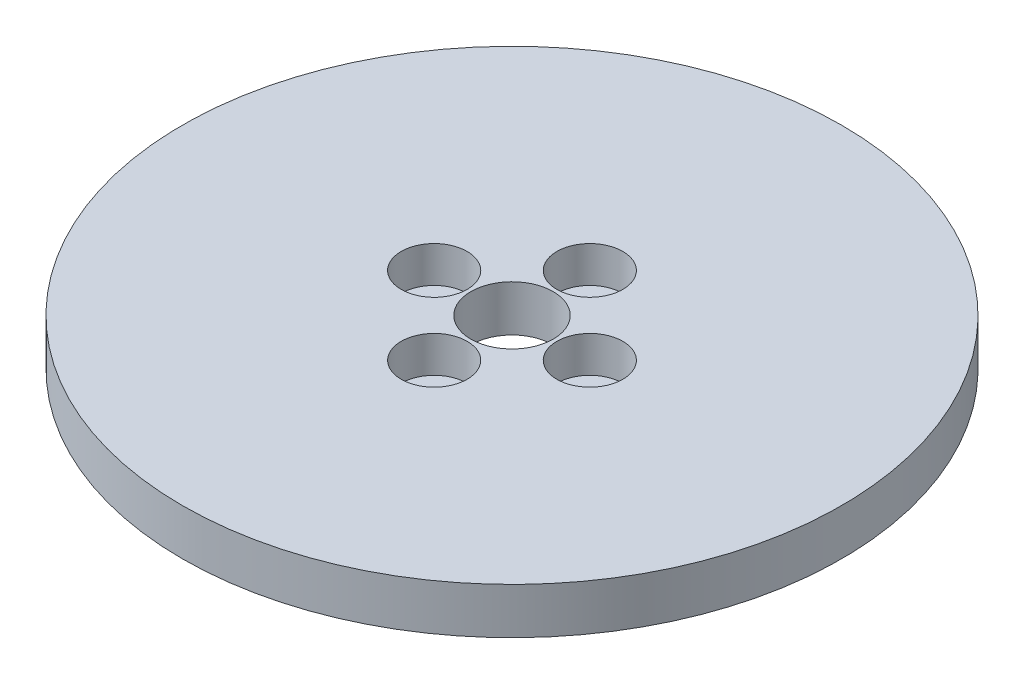
ISO-10303-21;
HEADER;
FILE_DESCRIPTION(('STEP AP214'),'2;1');
FILE_NAME('part.step','',(''),(''),'','','');
FILE_SCHEMA(('AUTOMOTIVE_DESIGN { 1 0 10303 214 1 1 1 1 }'));
ENDSEC;
DATA;
#1=APPLICATION_CONTEXT('core data for automotive mechanical design processes');
#2=APPLICATION_PROTOCOL_DEFINITION('international standard','automotive_design',2000,#1);
#3=PRODUCT_CONTEXT('',#1,'mechanical');
#4=PRODUCT('Part','Part','',(#3));
#5=PRODUCT_RELATED_PRODUCT_CATEGORY('part','',(#4));
#6=PRODUCT_DEFINITION_FORMATION('','',#4);
#7=PRODUCT_DEFINITION_CONTEXT('part definition',#1,'design');
#8=PRODUCT_DEFINITION('design','',#6,#7);
#9=PRODUCT_DEFINITION_SHAPE('','',#8);
#10=(LENGTH_UNIT() NAMED_UNIT(*) SI_UNIT(.MILLI.,.METRE.));
#11=(NAMED_UNIT(*) PLANE_ANGLE_UNIT() SI_UNIT($,.RADIAN.));
#12=(NAMED_UNIT(*) SI_UNIT($,.STERADIAN.) SOLID_ANGLE_UNIT());
#13=UNCERTAINTY_MEASURE_WITH_UNIT(LENGTH_MEASURE(1.E-05),#10,'distance_accuracy_value','');
#14=(GEOMETRIC_REPRESENTATION_CONTEXT(3) GLOBAL_UNCERTAINTY_ASSIGNED_CONTEXT((#13)) GLOBAL_UNIT_ASSIGNED_CONTEXT((#10,
#11,#12)) REPRESENTATION_CONTEXT('',''));
#15=CARTESIAN_POINT('',(0.,0.,0.));
#16=DIRECTION('',(0.,0.,1.));
#17=DIRECTION('',(1.,0.,0.));
#18=AXIS2_PLACEMENT_3D('',#15,#16,#17);
#19=CARTESIAN_POINT('',(0.,14.,0.));
#20=DIRECTION('',(0.,-1.,0.));
#21=DIRECTION('',(0.,0.,-1.));
#22=AXIS2_PLACEMENT_3D('',#19,#20,#21);
#23=CYLINDRICAL_SURFACE('',#22,100.);
#24=CARTESIAN_POINT('',(0.,14.,0.));
#25=DIRECTION('',(0.,1.,0.));
#26=DIRECTION('',(0.,0.,1.));
#27=AXIS2_PLACEMENT_3D('',#24,#25,#26);
#28=CIRCLE('',#27,100.);
#29=CARTESIAN_POINT('',(0.,14.,100.));
#30=VERTEX_POINT('',#29);
#31=EDGE_CURVE('E10',#30,#30,#28,.T.);
#32=ORIENTED_EDGE('',*,*,#31,.F.);
#33=EDGE_LOOP('',(#32));
#34=FACE_BOUND('',#33,.T.);
#35=CARTESIAN_POINT('',(0.,0.,0.));
#36=DIRECTION('',(0.,1.,0.));
#37=DIRECTION('',(0.,0.,1.));
#38=AXIS2_PLACEMENT_3D('',#35,#36,#37);
#39=CIRCLE('',#38,100.);
#40=CARTESIAN_POINT('',(0.,0.,100.));
#41=VERTEX_POINT('',#40);
#42=EDGE_CURVE('E37',#41,#41,#39,.T.);
#43=ORIENTED_EDGE('',*,*,#42,.T.);
#44=EDGE_LOOP('',(#43));
#45=FACE_BOUND('',#44,.T.);
#46=ADVANCED_FACE('F40',(#34,#45),#23,.T.);
#47=CARTESIAN_POINT('',(0.,14.,0.));
#48=DIRECTION('',(0.,1.,0.));
#49=DIRECTION('',(0.,0.,1.));
#50=AXIS2_PLACEMENT_3D('',#47,#48,#49);
#51=PLANE('',#50);
#52=CARTESIAN_POINT('',(0.,14.,23.6167152226861));
#53=DIRECTION('',(0.,1.,0.));
#54=DIRECTION('',(1.,0.,0.));
#55=AXIS2_PLACEMENT_3D('',#52,#53,#54);
#56=CIRCLE('',#55,10.);
#57=CARTESIAN_POINT('',(10.0000000000001,14.,23.6167152226861));
#58=VERTEX_POINT('',#57);
#59=EDGE_CURVE('E71',#58,#58,#56,.T.);
#60=ORIENTED_EDGE('',*,*,#59,.F.);
#61=EDGE_LOOP('',(#60));
#62=FACE_BOUND('',#61,.T.);
#63=CARTESIAN_POINT('',(23.6167152226861,14.,0.));
#64=DIRECTION('',(0.,1.,0.));
#65=DIRECTION('',(0.,0.,-1.));
#66=AXIS2_PLACEMENT_3D('',#63,#64,#65);
#67=CIRCLE('',#66,10.);
#68=CARTESIAN_POINT('',(23.6167152226861,14.,-10.));
#69=VERTEX_POINT('',#68);
#70=EDGE_CURVE('E70',#69,#69,#67,.T.);
#71=ORIENTED_EDGE('',*,*,#70,.F.);
#72=EDGE_LOOP('',(#71));
#73=FACE_BOUND('',#72,.T.);
#74=CARTESIAN_POINT('',(-2.47371961454343E-13,14.,-23.6167152226861));
#75=DIRECTION('',(0.,1.,0.));
#76=DIRECTION('',(-1.,0.,0.));
#77=AXIS2_PLACEMENT_3D('',#74,#75,#76);
#78=CIRCLE('',#77,10.);
#79=CARTESIAN_POINT('',(-10.0000000000002,14.,-23.616715222686));
#80=VERTEX_POINT('',#79);
#81=EDGE_CURVE('E61',#80,#80,#78,.T.);
#82=ORIENTED_EDGE('',*,*,#81,.F.);
#83=EDGE_LOOP('',(#82));
#84=FACE_BOUND('',#83,.T.);
#85=CARTESIAN_POINT('',(-23.6167152226861,14.,0.));
#86=DIRECTION('',(0.,1.,0.));
#87=DIRECTION('',(0.,0.,1.));
#88=AXIS2_PLACEMENT_3D('',#85,#86,#87);
#89=CIRCLE('',#88,10.);
#90=CARTESIAN_POINT('',(-23.6167152226861,14.,10.));
#91=VERTEX_POINT('',#90);
#92=EDGE_CURVE('E54',#91,#91,#89,.T.);
#93=ORIENTED_EDGE('',*,*,#92,.F.);
#94=EDGE_LOOP('',(#93));
#95=FACE_BOUND('',#94,.T.);
#96=CARTESIAN_POINT('',(0.,14.,0.));
#97=DIRECTION('',(0.,1.,0.));
#98=DIRECTION('',(0.,0.,1.));
#99=AXIS2_PLACEMENT_3D('',#96,#97,#98);
#100=CIRCLE('',#99,12.5);
#101=CARTESIAN_POINT('',(0.,14.,12.5));
#102=VERTEX_POINT('',#101);
#103=EDGE_CURVE('E50',#102,#102,#100,.T.);
#104=ORIENTED_EDGE('',*,*,#103,.F.);
#105=EDGE_LOOP('',(#104));
#106=FACE_BOUND('',#105,.T.);
#107=ORIENTED_EDGE('',*,*,#31,.T.);
#108=EDGE_LOOP('',(#107));
#109=FACE_BOUND('',#108,.T.);
#110=ADVANCED_FACE('F86',(#62,#73,#84,#95,#106,#109),#51,.T.);
#111=CARTESIAN_POINT('',(0.,0.,0.));
#112=DIRECTION('',(0.,1.,0.));
#113=DIRECTION('',(0.,0.,1.));
#114=AXIS2_PLACEMENT_3D('',#111,#112,#113);
#115=PLANE('',#114);
#116=CARTESIAN_POINT('',(0.,0.,0.));
#117=DIRECTION('',(0.,1.,0.));
#118=DIRECTION('',(0.,0.,1.));
#119=AXIS2_PLACEMENT_3D('',#116,#117,#118);
#120=CIRCLE('',#119,12.5);
#121=CARTESIAN_POINT('',(0.,0.,12.5));
#122=VERTEX_POINT('',#121);
#123=EDGE_CURVE('E47',#122,#122,#120,.T.);
#124=ORIENTED_EDGE('',*,*,#123,.T.);
#125=EDGE_LOOP('',(#124));
#126=FACE_BOUND('',#125,.T.);
#127=ORIENTED_EDGE('',*,*,#42,.F.);
#128=EDGE_LOOP('',(#127));
#129=FACE_BOUND('',#128,.T.);
#130=ADVANCED_FACE('F93',(#126,#129),#115,.F.);
#131=CARTESIAN_POINT('',(0.,14.,0.));
#132=DIRECTION('',(0.,-1.,0.));
#133=DIRECTION('',(0.,0.,-1.));
#134=AXIS2_PLACEMENT_3D('',#131,#132,#133);
#135=CYLINDRICAL_SURFACE('',#134,12.5);
#136=ORIENTED_EDGE('',*,*,#103,.T.);
#137=EDGE_LOOP('',(#136));
#138=FACE_BOUND('',#137,.T.);
#139=ORIENTED_EDGE('',*,*,#123,.F.);
#140=EDGE_LOOP('',(#139));
#141=FACE_BOUND('',#140,.T.);
#142=ADVANCED_FACE('F101',(#138,#141),#135,.F.);
#143=CARTESIAN_POINT('',(-23.6167152226861,2.98458764076872,0.));
#144=DIRECTION('',(0.,1.,0.));
#145=DIRECTION('',(0.,0.,1.));
#146=AXIS2_PLACEMENT_3D('',#143,#144,#145);
#147=CYLINDRICAL_SURFACE('',#146,10.);
#148=CARTESIAN_POINT('',(-23.6167152226861,2.98458764076872,0.));
#149=DIRECTION('',(0.,1.,0.));
#150=DIRECTION('',(0.,0.,1.));
#151=AXIS2_PLACEMENT_3D('',#148,#149,#150);
#152=CIRCLE('',#151,10.);
#153=CARTESIAN_POINT('',(-23.6167152226861,2.98458764076872,10.));
#154=VERTEX_POINT('',#153);
#155=EDGE_CURVE('E55',#154,#154,#152,.T.);
#156=ORIENTED_EDGE('',*,*,#155,.F.);
#157=EDGE_LOOP('',(#156));
#158=FACE_BOUND('',#157,.T.);
#159=ORIENTED_EDGE('',*,*,#92,.T.);
#160=EDGE_LOOP('',(#159));
#161=FACE_BOUND('',#160,.T.);
#162=ADVANCED_FACE('F102',(#158,#161),#147,.F.);
#163=CARTESIAN_POINT('',(-23.6167152226861,2.98458764076872,0.));
#164=DIRECTION('',(0.,1.,0.));
#165=DIRECTION('',(0.,0.,1.));
#166=AXIS2_PLACEMENT_3D('',#163,#164,#165);
#167=PLANE('',#166);
#168=ORIENTED_EDGE('',*,*,#155,.T.);
#169=EDGE_LOOP('',(#168));
#170=FACE_BOUND('',#169,.T.);
#171=ADVANCED_FACE('F133',(#170),#167,.T.);
#172=CARTESIAN_POINT('',(-2.47371961454343E-13,2.98458764076872,-23.6167152226861));
#173=DIRECTION('',(0.,1.,0.));
#174=DIRECTION('',(0.,0.,1.));
#175=AXIS2_PLACEMENT_3D('',#172,#173,#174);
#176=CYLINDRICAL_SURFACE('',#175,10.);
#177=CARTESIAN_POINT('',(-2.47371961454343E-13,2.98458764076872,-23.6167152226861));
#178=DIRECTION('',(0.,1.,0.));
#179=DIRECTION('',(-1.,0.,0.));
#180=AXIS2_PLACEMENT_3D('',#177,#178,#179);
#181=CIRCLE('',#180,10.);
#182=CARTESIAN_POINT('',(-10.0000000000002,2.98458764076872,-23.616715222686));
#183=VERTEX_POINT('',#182);
#184=EDGE_CURVE('E63',#183,#183,#181,.T.);
#185=ORIENTED_EDGE('',*,*,#184,.F.);
#186=EDGE_LOOP('',(#185));
#187=FACE_BOUND('',#186,.T.);
#188=ORIENTED_EDGE('',*,*,#81,.T.);
#189=EDGE_LOOP('',(#188));
#190=FACE_BOUND('',#189,.T.);
#191=ADVANCED_FACE('F142',(#187,#190),#176,.F.);
#192=CARTESIAN_POINT('',(-2.47371961454343E-13,2.98458764076872,-23.6167152226861));
#193=DIRECTION('',(0.,1.,0.));
#194=DIRECTION('',(-1.,0.,0.));
#195=AXIS2_PLACEMENT_3D('',#192,#193,#194);
#196=PLANE('',#195);
#197=ORIENTED_EDGE('',*,*,#184,.T.);
#198=EDGE_LOOP('',(#197));
#199=FACE_BOUND('',#198,.T.);
#200=ADVANCED_FACE('F156',(#199),#196,.T.);
#201=CARTESIAN_POINT('',(23.6167152226861,2.98458764076872,0.));
#202=DIRECTION('',(0.,1.,0.));
#203=DIRECTION('',(0.,0.,1.));
#204=AXIS2_PLACEMENT_3D('',#201,#202,#203);
#205=CYLINDRICAL_SURFACE('',#204,10.);
#206=CARTESIAN_POINT('',(23.6167152226861,2.98458764076872,0.));
#207=DIRECTION('',(0.,1.,0.));
#208=DIRECTION('',(0.,0.,-1.));
#209=AXIS2_PLACEMENT_3D('',#206,#207,#208);
#210=CIRCLE('',#209,10.);
#211=CARTESIAN_POINT('',(23.6167152226861,2.98458764076872,-10.));
#212=VERTEX_POINT('',#211);
#213=EDGE_CURVE('E69',#212,#212,#210,.T.);
#214=ORIENTED_EDGE('',*,*,#213,.F.);
#215=EDGE_LOOP('',(#214));
#216=FACE_BOUND('',#215,.T.);
#217=ORIENTED_EDGE('',*,*,#70,.T.);
#218=EDGE_LOOP('',(#217));
#219=FACE_BOUND('',#218,.T.);
#220=ADVANCED_FACE('F164',(#216,#219),#205,.F.);
#221=CARTESIAN_POINT('',(23.6167152226861,2.98458764076872,0.));
#222=DIRECTION('',(0.,1.,0.));
#223=DIRECTION('',(0.,0.,-1.));
#224=AXIS2_PLACEMENT_3D('',#221,#222,#223);
#225=PLANE('',#224);
#226=ORIENTED_EDGE('',*,*,#213,.T.);
#227=EDGE_LOOP('',(#226));
#228=FACE_BOUND('',#227,.T.);
#229=ADVANCED_FACE('F83',(#228),#225,.T.);
#230=CARTESIAN_POINT('',(0.,2.98458764076872,23.6167152226861));
#231=DIRECTION('',(0.,1.,0.));
#232=DIRECTION('',(0.,0.,1.));
#233=AXIS2_PLACEMENT_3D('',#230,#231,#232);
#234=CYLINDRICAL_SURFACE('',#233,10.);
#235=CARTESIAN_POINT('',(0.,2.98458764076872,23.6167152226861));
#236=DIRECTION('',(0.,1.,0.));
#237=DIRECTION('',(1.,0.,0.));
#238=AXIS2_PLACEMENT_3D('',#235,#236,#237);
#239=CIRCLE('',#238,10.);
#240=CARTESIAN_POINT('',(10.0000000000001,2.98458764076872,23.6167152226861));
#241=VERTEX_POINT('',#240);
#242=EDGE_CURVE('E59',#241,#241,#239,.T.);
#243=ORIENTED_EDGE('',*,*,#242,.F.);
#244=EDGE_LOOP('',(#243));
#245=FACE_BOUND('',#244,.T.);
#246=ORIENTED_EDGE('',*,*,#59,.T.);
#247=EDGE_LOOP('',(#246));
#248=FACE_BOUND('',#247,.T.);
#249=ADVANCED_FACE('F81',(#245,#248),#234,.F.);
#250=CARTESIAN_POINT('',(0.,2.98458764076872,23.6167152226861));
#251=DIRECTION('',(0.,1.,0.));
#252=DIRECTION('',(1.,0.,0.));
#253=AXIS2_PLACEMENT_3D('',#250,#251,#252);
#254=PLANE('',#253);
#255=ORIENTED_EDGE('',*,*,#242,.T.);
#256=EDGE_LOOP('',(#255));
#257=FACE_BOUND('',#256,.T.);
#258=ADVANCED_FACE('F78',(#257),#254,.T.);
#259=CLOSED_SHELL('',(#46,#110,#130,#142,#162,#171,#191,#200,#220,#229,#249,#258));
#260=MANIFOLD_SOLID_BREP('B2',#259);
#261=ADVANCED_BREP_SHAPE_REPRESENTATION('',(#18,#260),#14);
#262=SHAPE_DEFINITION_REPRESENTATION(#9,#261);
ENDSEC;
END-ISO-10303-21;
